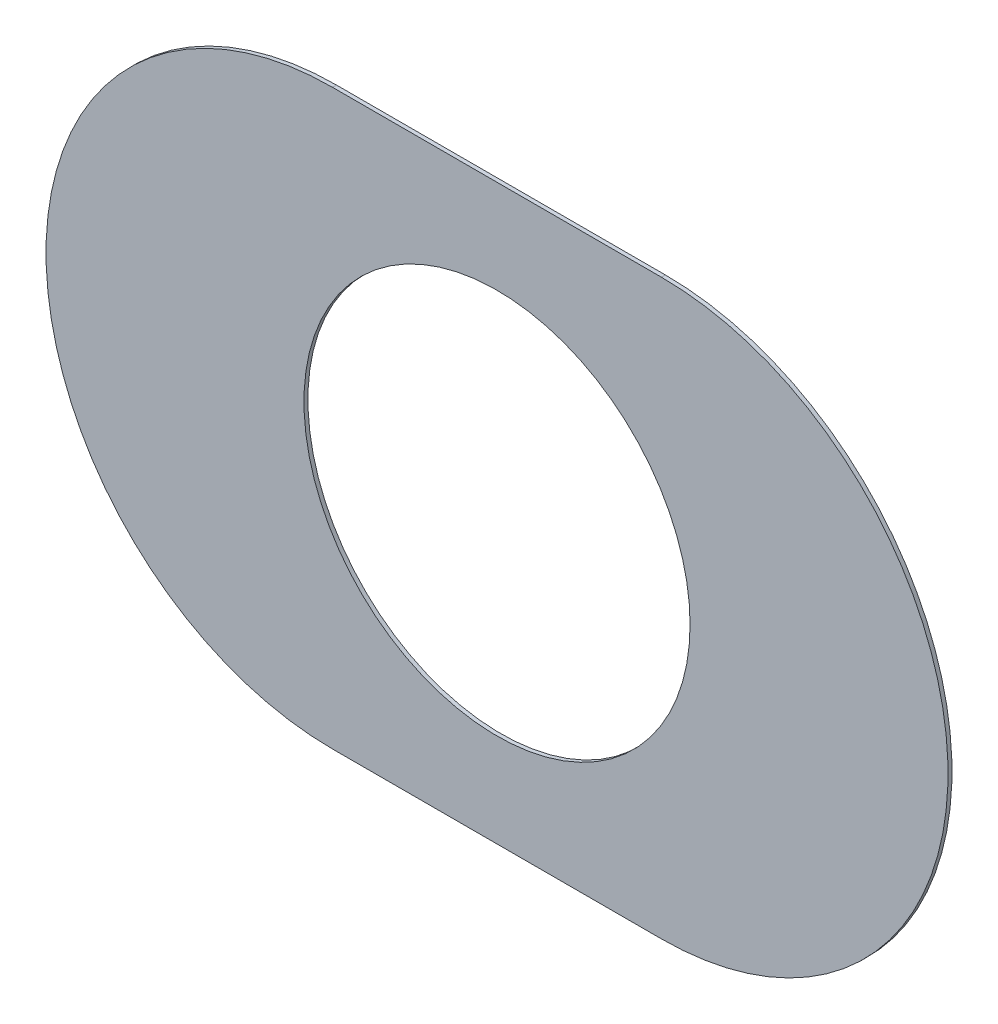
ISO-10303-21;
HEADER;
FILE_DESCRIPTION(('STEP AP214'),'2;1');
FILE_NAME('part.step','',(''),(''),'','','');
FILE_SCHEMA(('AUTOMOTIVE_DESIGN { 1 0 10303 214 1 1 1 1 }'));
ENDSEC;
DATA;
#1=APPLICATION_CONTEXT('core data for automotive mechanical design processes');
#2=APPLICATION_PROTOCOL_DEFINITION('international standard','automotive_design',2000,#1);
#3=PRODUCT_CONTEXT('',#1,'mechanical');
#4=PRODUCT('Part','Part','',(#3));
#5=PRODUCT_RELATED_PRODUCT_CATEGORY('part','',(#4));
#6=PRODUCT_DEFINITION_FORMATION('','',#4);
#7=PRODUCT_DEFINITION_CONTEXT('part definition',#1,'design');
#8=PRODUCT_DEFINITION('design','',#6,#7);
#9=PRODUCT_DEFINITION_SHAPE('','',#8);
#10=(LENGTH_UNIT() NAMED_UNIT(*) SI_UNIT(.MILLI.,.METRE.));
#11=(NAMED_UNIT(*) PLANE_ANGLE_UNIT() SI_UNIT($,.RADIAN.));
#12=(NAMED_UNIT(*) SI_UNIT($,.STERADIAN.) SOLID_ANGLE_UNIT());
#13=UNCERTAINTY_MEASURE_WITH_UNIT(LENGTH_MEASURE(1.E-05),#10,'distance_accuracy_value','');
#14=(GEOMETRIC_REPRESENTATION_CONTEXT(3) GLOBAL_UNCERTAINTY_ASSIGNED_CONTEXT((#13)) GLOBAL_UNIT_ASSIGNED_CONTEXT((#10,
#11,#12)) REPRESENTATION_CONTEXT('',''));
#15=CARTESIAN_POINT('',(0.,0.,0.));
#16=DIRECTION('',(0.,0.,1.));
#17=DIRECTION('',(1.,0.,0.));
#18=AXIS2_PLACEMENT_3D('',#15,#16,#17);
#19=CARTESIAN_POINT('',(24.3000003427268,14.5400006854535,0.));
#20=DIRECTION('',(0.,0.,1.));
#21=DIRECTION('',(1.,0.,0.));
#22=AXIS2_PLACEMENT_3D('',#19,#20,#21);
#23=PLANE('',#22);
#24=CARTESIAN_POINT('',(24.3000003427268,14.5400006854535,0.));
#25=DIRECTION('',(0.,0.,-1.));
#26=DIRECTION('',(-1.,0.,0.));
#27=AXIS2_PLACEMENT_3D('',#24,#25,#26);
#28=CIRCLE('',#27,0.49);
#29=CARTESIAN_POINT('',(24.7900003427268,14.5400006854535,0.));
#30=VERTEX_POINT('',#29);
#31=EDGE_CURVE('E94',#30,#30,#28,.T.);
#32=ORIENTED_EDGE('',*,*,#31,.T.);
#33=EDGE_LOOP('',(#32));
#34=FACE_BOUND('',#33,.T.);
#35=CARTESIAN_POINT('',(23.8825938881802,14.5400006854535,0.));
#36=DIRECTION('',(0.,0.,1.));
#37=DIRECTION('',(0.,1.,0.));
#38=AXIS2_PLACEMENT_3D('',#35,#36,#37);
#39=CIRCLE('',#38,0.727257121659981);
#40=CARTESIAN_POINT('',(23.8825938881802,15.2672578071135,0.));
#41=VERTEX_POINT('',#40);
#42=CARTESIAN_POINT('',(23.8825938881802,13.8127435637935,0.));
#43=VERTEX_POINT('',#42);
#44=EDGE_CURVE('E28',#41,#43,#39,.T.);
#45=ORIENTED_EDGE('',*,*,#44,.T.);
#46=DIRECTION('',(1.,0.,0.));
#47=VECTOR('',#46,1.);
#48=CARTESIAN_POINT('',(23.8825938881802,13.8127435637935,0.));
#49=LINE('',#48,#47);
#50=CARTESIAN_POINT('',(24.7174067972734,13.8127435637935,0.));
#51=VERTEX_POINT('',#50);
#52=EDGE_CURVE('E111',#43,#51,#49,.T.);
#53=ORIENTED_EDGE('',*,*,#52,.T.);
#54=CARTESIAN_POINT('',(24.7174067972734,14.5400006854535,0.));
#55=DIRECTION('',(0.,0.,1.));
#56=DIRECTION('',(0.,-1.,0.));
#57=AXIS2_PLACEMENT_3D('',#54,#55,#56);
#58=CIRCLE('',#57,0.727257121659981);
#59=CARTESIAN_POINT('',(24.7174067972734,15.2672578071135,0.));
#60=VERTEX_POINT('',#59);
#61=EDGE_CURVE('E65',#51,#60,#58,.T.);
#62=ORIENTED_EDGE('',*,*,#61,.T.);
#63=DIRECTION('',(-1.,0.,0.));
#64=VECTOR('',#63,1.);
#65=CARTESIAN_POINT('',(24.7174067972734,15.2672578071135,0.));
#66=LINE('',#65,#64);
#67=EDGE_CURVE('E100',#60,#41,#66,.T.);
#68=ORIENTED_EDGE('',*,*,#67,.T.);
#69=EDGE_LOOP('',(#45,#53,#62,#68));
#70=FACE_BOUND('',#69,.T.);
#71=ADVANCED_FACE('F17',(#34,#70),#23,.T.);
#72=CARTESIAN_POINT('',(24.3000003427268,14.5400006854535,-0.01));
#73=DIRECTION('',(0.,0.,1.));
#74=DIRECTION('',(1.,0.,0.));
#75=AXIS2_PLACEMENT_3D('',#72,#73,#74);
#76=PLANE('',#75);
#77=CARTESIAN_POINT('',(24.3000003427268,14.5400006854535,-0.01));
#78=DIRECTION('',(0.,0.,-1.));
#79=DIRECTION('',(-1.,0.,0.));
#80=AXIS2_PLACEMENT_3D('',#77,#78,#79);
#81=CIRCLE('',#80,0.49);
#82=CARTESIAN_POINT('',(24.7900003427268,14.5400006854535,-0.01));
#83=VERTEX_POINT('',#82);
#84=EDGE_CURVE('E93',#83,#83,#81,.T.);
#85=ORIENTED_EDGE('',*,*,#84,.F.);
#86=EDGE_LOOP('',(#85));
#87=FACE_BOUND('',#86,.T.);
#88=CARTESIAN_POINT('',(23.8825938881802,14.5400006854535,-0.01));
#89=DIRECTION('',(0.,0.,1.));
#90=DIRECTION('',(0.,1.,0.));
#91=AXIS2_PLACEMENT_3D('',#88,#89,#90);
#92=CIRCLE('',#91,0.727257121659981);
#93=CARTESIAN_POINT('',(23.8825938881802,15.2672578071135,-0.01));
#94=VERTEX_POINT('',#93);
#95=CARTESIAN_POINT('',(23.8825938881802,13.8127435637935,-0.01));
#96=VERTEX_POINT('',#95);
#97=EDGE_CURVE('E11',#94,#96,#92,.T.);
#98=ORIENTED_EDGE('',*,*,#97,.F.);
#99=DIRECTION('',(-1.,0.,0.));
#100=VECTOR('',#99,1.);
#101=CARTESIAN_POINT('',(24.7174067972734,15.2672578071135,-0.01));
#102=LINE('',#101,#100);
#103=CARTESIAN_POINT('',(24.7174067972734,15.2672578071135,-0.01));
#104=VERTEX_POINT('',#103);
#105=EDGE_CURVE('E121',#104,#94,#102,.T.);
#106=ORIENTED_EDGE('',*,*,#105,.F.);
#107=CARTESIAN_POINT('',(24.7174067972734,14.5400006854535,-0.01));
#108=DIRECTION('',(0.,0.,1.));
#109=DIRECTION('',(0.,-1.,0.));
#110=AXIS2_PLACEMENT_3D('',#107,#108,#109);
#111=CIRCLE('',#110,0.727257121659981);
#112=CARTESIAN_POINT('',(24.7174067972734,13.8127435637935,-0.01));
#113=VERTEX_POINT('',#112);
#114=EDGE_CURVE('E78',#113,#104,#111,.T.);
#115=ORIENTED_EDGE('',*,*,#114,.F.);
#116=DIRECTION('',(1.,0.,0.));
#117=VECTOR('',#116,1.);
#118=CARTESIAN_POINT('',(23.8825938881802,13.8127435637935,-0.01));
#119=LINE('',#118,#117);
#120=EDGE_CURVE('E110',#96,#113,#119,.T.);
#121=ORIENTED_EDGE('',*,*,#120,.F.);
#122=EDGE_LOOP('',(#98,#106,#115,#121));
#123=FACE_BOUND('',#122,.T.);
#124=ADVANCED_FACE('F138',(#87,#123),#76,.F.);
#125=CARTESIAN_POINT('',(23.8825938881802,14.5400006854535,0.));
#126=DIRECTION('',(0.,0.,1.));
#127=DIRECTION('',(0.,1.,0.));
#128=AXIS2_PLACEMENT_3D('',#125,#126,#127);
#129=CYLINDRICAL_SURFACE('',#128,0.727257121659981);
#130=ORIENTED_EDGE('',*,*,#44,.F.);
#131=DIRECTION('',(0.,0.,-1.));
#132=VECTOR('',#131,1.);
#133=CARTESIAN_POINT('',(23.8825938881802,15.2672578071135,0.));
#134=LINE('',#133,#132);
#135=EDGE_CURVE('E128',#41,#94,#134,.T.);
#136=ORIENTED_EDGE('',*,*,#135,.T.);
#137=ORIENTED_EDGE('',*,*,#97,.T.);
#138=DIRECTION('',(0.,0.,-1.));
#139=VECTOR('',#138,1.);
#140=CARTESIAN_POINT('',(23.8825938881802,13.8127435637935,0.));
#141=LINE('',#140,#139);
#142=EDGE_CURVE('E106',#43,#96,#141,.T.);
#143=ORIENTED_EDGE('',*,*,#142,.F.);
#144=EDGE_LOOP('',(#130,#136,#137,#143));
#145=FACE_BOUND('',#144,.T.);
#146=ADVANCED_FACE('F139',(#145),#129,.T.);
#147=CARTESIAN_POINT('',(23.8825938881802,13.8127435637935,0.));
#148=DIRECTION('',(0.,1.,0.));
#149=DIRECTION('',(1.,0.,0.));
#150=AXIS2_PLACEMENT_3D('',#147,#148,#149);
#151=PLANE('',#150);
#152=ORIENTED_EDGE('',*,*,#52,.F.);
#153=ORIENTED_EDGE('',*,*,#142,.T.);
#154=ORIENTED_EDGE('',*,*,#120,.T.);
#155=DIRECTION('',(0.,0.,-1.));
#156=VECTOR('',#155,1.);
#157=CARTESIAN_POINT('',(24.7174067972734,13.8127435637935,0.));
#158=LINE('',#157,#156);
#159=EDGE_CURVE('E21',#51,#113,#158,.T.);
#160=ORIENTED_EDGE('',*,*,#159,.F.);
#161=EDGE_LOOP('',(#152,#153,#154,#160));
#162=FACE_BOUND('',#161,.T.);
#163=ADVANCED_FACE('F19',(#162),#151,.F.);
#164=CARTESIAN_POINT('',(24.7174067972734,14.5400006854535,0.));
#165=DIRECTION('',(0.,0.,1.));
#166=DIRECTION('',(0.,-1.,0.));
#167=AXIS2_PLACEMENT_3D('',#164,#165,#166);
#168=CYLINDRICAL_SURFACE('',#167,0.727257121659981);
#169=ORIENTED_EDGE('',*,*,#61,.F.);
#170=ORIENTED_EDGE('',*,*,#159,.T.);
#171=ORIENTED_EDGE('',*,*,#114,.T.);
#172=DIRECTION('',(0.,0.,-1.));
#173=VECTOR('',#172,1.);
#174=CARTESIAN_POINT('',(24.7174067972734,15.2672578071135,0.));
#175=LINE('',#174,#173);
#176=EDGE_CURVE('E117',#60,#104,#175,.T.);
#177=ORIENTED_EDGE('',*,*,#176,.F.);
#178=EDGE_LOOP('',(#169,#170,#171,#177));
#179=FACE_BOUND('',#178,.T.);
#180=ADVANCED_FACE('F146',(#179),#168,.T.);
#181=CARTESIAN_POINT('',(24.7174067972734,15.2672578071135,0.));
#182=DIRECTION('',(0.,-1.,0.));
#183=DIRECTION('',(0.,0.,-1.));
#184=AXIS2_PLACEMENT_3D('',#181,#182,#183);
#185=PLANE('',#184);
#186=ORIENTED_EDGE('',*,*,#67,.F.);
#187=ORIENTED_EDGE('',*,*,#176,.T.);
#188=ORIENTED_EDGE('',*,*,#105,.T.);
#189=ORIENTED_EDGE('',*,*,#135,.F.);
#190=EDGE_LOOP('',(#186,#187,#188,#189));
#191=FACE_BOUND('',#190,.T.);
#192=ADVANCED_FACE('F136',(#191),#185,.F.);
#193=CARTESIAN_POINT('',(24.3000003427268,14.5400006854535,0.));
#194=DIRECTION('',(0.,0.,1.));
#195=DIRECTION('',(-1.,0.,0.));
#196=AXIS2_PLACEMENT_3D('',#193,#194,#195);
#197=CYLINDRICAL_SURFACE('',#196,0.49);
#198=ORIENTED_EDGE('',*,*,#84,.T.);
#199=DIRECTION('',(0.,0.,1.));
#200=VECTOR('',#199,1.);
#201=CARTESIAN_POINT('',(24.7900003427268,14.5400006854535,0.));
#202=LINE('',#201,#200);
#203=EDGE_CURVE('E90',#83,#30,#202,.T.);
#204=ORIENTED_EDGE('',*,*,#203,.T.);
#205=ORIENTED_EDGE('',*,*,#31,.F.);
#206=ORIENTED_EDGE('',*,*,#203,.F.);
#207=EDGE_LOOP('',(#198,#204,#205,#206));
#208=FACE_BOUND('',#207,.T.);
#209=ADVANCED_FACE('F91',(#208),#197,.F.);
#210=CLOSED_SHELL('',(#71,#124,#146,#163,#180,#192,#209));
#211=MANIFOLD_SOLID_BREP('B1',#210);
#212=ADVANCED_BREP_SHAPE_REPRESENTATION('',(#18,#211),#14);
#213=SHAPE_DEFINITION_REPRESENTATION(#9,#212);
ENDSEC;
END-ISO-10303-21;
